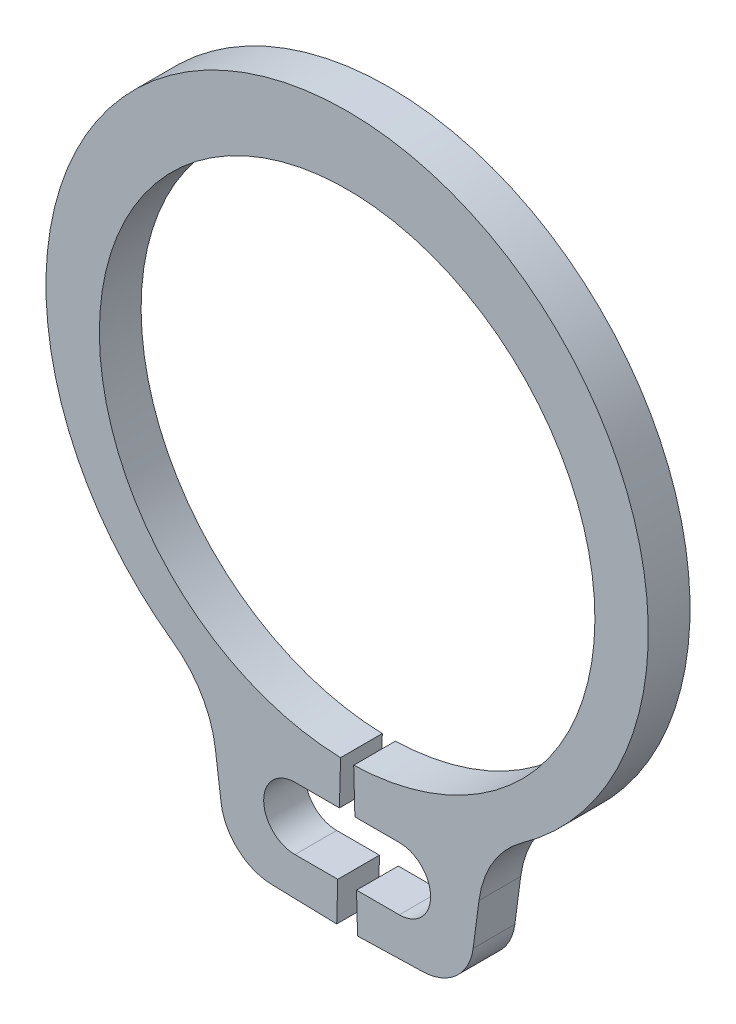
ISO-10303-21;
HEADER;
FILE_DESCRIPTION(('STEP AP214'),'2;1');
FILE_NAME('part.step','',(''),(''),'','','');
FILE_SCHEMA(('AUTOMOTIVE_DESIGN { 1 0 10303 214 1 1 1 1 }'));
ENDSEC;
DATA;
#1=APPLICATION_CONTEXT('core data for automotive mechanical design processes');
#2=APPLICATION_PROTOCOL_DEFINITION('international standard','automotive_design',2000,#1);
#3=PRODUCT_CONTEXT('',#1,'mechanical');
#4=PRODUCT('Part','Part','',(#3));
#5=PRODUCT_RELATED_PRODUCT_CATEGORY('part','',(#4));
#6=PRODUCT_DEFINITION_FORMATION('','',#4);
#7=PRODUCT_DEFINITION_CONTEXT('part definition',#1,'design');
#8=PRODUCT_DEFINITION('design','',#6,#7);
#9=PRODUCT_DEFINITION_SHAPE('','',#8);
#10=(LENGTH_UNIT() NAMED_UNIT(*) SI_UNIT(.MILLI.,.METRE.));
#11=(NAMED_UNIT(*) PLANE_ANGLE_UNIT() SI_UNIT($,.RADIAN.));
#12=(NAMED_UNIT(*) SI_UNIT($,.STERADIAN.) SOLID_ANGLE_UNIT());
#13=UNCERTAINTY_MEASURE_WITH_UNIT(LENGTH_MEASURE(1.E-05),#10,'distance_accuracy_value','');
#14=(GEOMETRIC_REPRESENTATION_CONTEXT(3) GLOBAL_UNCERTAINTY_ASSIGNED_CONTEXT((#13)) GLOBAL_UNIT_ASSIGNED_CONTEXT((#10,
#11,#12)) REPRESENTATION_CONTEXT('',''));
#15=CARTESIAN_POINT('',(0.,0.,0.));
#16=DIRECTION('',(0.,0.,1.));
#17=DIRECTION('',(1.,0.,0.));
#18=AXIS2_PLACEMENT_3D('',#15,#16,#17);
#19=CARTESIAN_POINT('',(-0.0629139072847682,-2.37416655697745,-0.4));
#20=DIRECTION('',(0.999649076622085,-0.0264900662251656,0.));
#21=DIRECTION('',(0.0264900662251656,0.999649076622085,0.));
#22=AXIS2_PLACEMENT_3D('',#19,#20,#21);
#23=PLANE('',#22);
#24=DIRECTION('',(0.,0.,1.));
#25=VECTOR('',#24,1.);
#26=CARTESIAN_POINT('',(-0.0741294083433198,-2.79740314618553,-0.4));
#27=LINE('',#26,#25);
#28=CARTESIAN_POINT('',(-0.0741294083433198,-2.79740314618553,-0.4));
#29=VERTEX_POINT('',#28);
#30=CARTESIAN_POINT('',(-0.0741294083433198,-2.79740314618553,0.));
#31=VERTEX_POINT('',#30);
#32=EDGE_CURVE('E201',#29,#31,#27,.T.);
#33=ORIENTED_EDGE('',*,*,#32,.F.);
#34=DIRECTION('',(0.0264900662251656,0.999649076622085,0.));
#35=VECTOR('',#34,1.);
#36=CARTESIAN_POINT('',(-0.0629139072847682,-2.37416655697745,-0.4));
#37=LINE('',#36,#35);
#38=CARTESIAN_POINT('',(-0.0629139072847682,-2.37416655697745,-0.4));
#39=VERTEX_POINT('',#38);
#40=EDGE_CURVE('E190',#29,#39,#37,.T.);
#41=ORIENTED_EDGE('',*,*,#40,.T.);
#42=DIRECTION('',(0.,0.,1.));
#43=VECTOR('',#42,1.);
#44=CARTESIAN_POINT('',(-0.0629139072847682,-2.37416655697745,-0.4));
#45=LINE('',#44,#43);
#46=CARTESIAN_POINT('',(-0.0629139072847682,-2.37416655697745,0.));
#47=VERTEX_POINT('',#46);
#48=EDGE_CURVE('E11',#39,#47,#45,.T.);
#49=ORIENTED_EDGE('',*,*,#48,.T.);
#50=DIRECTION('',(0.0264900662251656,0.999649076622085,0.));
#51=VECTOR('',#50,1.);
#52=CARTESIAN_POINT('',(-0.0629139072847682,-2.37416655697745,0.));
#53=LINE('',#52,#51);
#54=EDGE_CURVE('E279',#31,#47,#53,.T.);
#55=ORIENTED_EDGE('',*,*,#54,.F.);
#56=EDGE_LOOP('',(#33,#41,#49,#55));
#57=FACE_BOUND('',#56,.T.);
#58=ADVANCED_FACE('F30',(#57),#23,.T.);
#59=CARTESIAN_POINT('',(0.0629139072847682,-2.37416655697745,-0.4));
#60=DIRECTION('',(-0.999649076622085,-0.0264900662251656,0.));
#61=DIRECTION('',(0.0264900662251656,-0.999649076622085,0.));
#62=AXIS2_PLACEMENT_3D('',#59,#60,#61);
#63=PLANE('',#62);
#64=DIRECTION('',(0.,0.,-1.));
#65=VECTOR('',#64,1.);
#66=CARTESIAN_POINT('',(0.0741294083433198,-2.79740314618553,-0.4));
#67=LINE('',#66,#65);
#68=CARTESIAN_POINT('',(0.0741294083433198,-2.79740314618553,0.));
#69=VERTEX_POINT('',#68);
#70=CARTESIAN_POINT('',(0.0741294083433198,-2.79740314618553,-0.4));
#71=VERTEX_POINT('',#70);
#72=EDGE_CURVE('E312',#69,#71,#67,.T.);
#73=ORIENTED_EDGE('',*,*,#72,.F.);
#74=DIRECTION('',(0.0264900662251656,-0.999649076622085,0.));
#75=VECTOR('',#74,1.);
#76=CARTESIAN_POINT('',(0.0629139072847682,-2.37416655697745,0.));
#77=LINE('',#76,#75);
#78=CARTESIAN_POINT('',(0.0629139072847682,-2.37416655697745,0.));
#79=VERTEX_POINT('',#78);
#80=EDGE_CURVE('E249',#79,#69,#77,.T.);
#81=ORIENTED_EDGE('',*,*,#80,.F.);
#82=DIRECTION('',(0.,0.,1.));
#83=VECTOR('',#82,1.);
#84=CARTESIAN_POINT('',(0.0629139072847682,-2.37416655697745,-0.4));
#85=LINE('',#84,#83);
#86=CARTESIAN_POINT('',(0.0629139072847682,-2.37416655697745,-0.4));
#87=VERTEX_POINT('',#86);
#88=EDGE_CURVE('E34',#87,#79,#85,.T.);
#89=ORIENTED_EDGE('',*,*,#88,.F.);
#90=DIRECTION('',(0.0264900662251656,-0.999649076622085,0.));
#91=VECTOR('',#90,1.);
#92=CARTESIAN_POINT('',(0.0629139072847682,-2.37416655697745,-0.4));
#93=LINE('',#92,#91);
#94=EDGE_CURVE('E213',#87,#71,#93,.T.);
#95=ORIENTED_EDGE('',*,*,#94,.T.);
#96=EDGE_LOOP('',(#73,#81,#89,#95));
#97=FACE_BOUND('',#96,.T.);
#98=ADVANCED_FACE('F311',(#97),#63,.T.);
#99=CARTESIAN_POINT('',(0.,0.,-0.4));
#100=DIRECTION('',(0.,0.,1.));
#101=DIRECTION('',(1.,0.,0.));
#102=AXIS2_PLACEMENT_3D('',#99,#100,#101);
#103=CYLINDRICAL_SURFACE('',#102,2.375);
#104=CARTESIAN_POINT('',(0.,0.,0.));
#105=DIRECTION('',(0.,0.,-1.));
#106=DIRECTION('',(1.,0.,0.));
#107=AXIS2_PLACEMENT_3D('',#104,#105,#106);
#108=CIRCLE('',#107,2.375);
#109=EDGE_CURVE('E206',#47,#79,#108,.T.);
#110=ORIENTED_EDGE('',*,*,#109,.F.);
#111=ORIENTED_EDGE('',*,*,#48,.F.);
#112=CARTESIAN_POINT('',(0.,0.,-0.4));
#113=DIRECTION('',(0.,0.,-1.));
#114=DIRECTION('',(1.,0.,0.));
#115=AXIS2_PLACEMENT_3D('',#112,#113,#114);
#116=CIRCLE('',#115,2.375);
#117=EDGE_CURVE('E208',#39,#87,#116,.T.);
#118=ORIENTED_EDGE('',*,*,#117,.T.);
#119=ORIENTED_EDGE('',*,*,#88,.T.);
#120=EDGE_LOOP('',(#110,#111,#118,#119));
#121=FACE_BOUND('',#120,.T.);
#122=ADVANCED_FACE('F32',(#121),#103,.F.);
#123=DIRECTION('',(0.,0.,-1.));
#124=VECTOR('',#123,1.);
#125=CARTESIAN_POINT('',(-0.0900290276265256,-3.39740314618553,-0.4));
#126=LINE('',#125,#124);
#127=CARTESIAN_POINT('',(-0.0900290276265256,-3.39740314618553,0.));
#128=VERTEX_POINT('',#127);
#129=CARTESIAN_POINT('',(-0.0900290276265256,-3.39740314618553,-0.4));
#130=VERTEX_POINT('',#129);
#131=EDGE_CURVE('E333',#128,#130,#126,.T.);
#132=ORIENTED_EDGE('',*,*,#131,.F.);
#133=CARTESIAN_POINT('',(-0.1,-3.77367526424837,0.));
#134=VERTEX_POINT('',#133);
#135=EDGE_CURVE('E212',#134,#128,#53,.T.);
#136=ORIENTED_EDGE('',*,*,#135,.F.);
#137=DIRECTION('',(0.,0.,1.));
#138=VECTOR('',#137,1.);
#139=CARTESIAN_POINT('',(-0.1,-3.77367526424837,-0.4));
#140=LINE('',#139,#138);
#141=CARTESIAN_POINT('',(-0.1,-3.77367526424837,-0.4));
#142=VERTEX_POINT('',#141);
#143=EDGE_CURVE('E39',#142,#134,#140,.T.);
#144=ORIENTED_EDGE('',*,*,#143,.F.);
#145=EDGE_CURVE('E243',#142,#130,#37,.T.);
#146=ORIENTED_EDGE('',*,*,#145,.T.);
#147=EDGE_LOOP('',(#132,#136,#144,#146));
#148=FACE_BOUND('',#147,.T.);
#149=ADVANCED_FACE('F381',(#148),#23,.T.);
#150=CARTESIAN_POINT('',(-0.1,-3.77367526424837,-0.4));
#151=DIRECTION('',(-0.0264900662251672,-0.999649076622085,0.));
#152=DIRECTION('',(0.999649076622085,-0.0264900662251672,0.));
#153=AXIS2_PLACEMENT_3D('',#150,#151,#152);
#154=PLANE('',#153);
#155=DIRECTION('',(0.999649076622085,-0.0264900662251672,0.));
#156=VECTOR('',#155,1.);
#157=CARTESIAN_POINT('',(-0.1,-3.77367526424837,0.));
#158=LINE('',#157,#156);
#159=CARTESIAN_POINT('',(-0.725313694267848,-3.75710484812931,0.));
#160=VERTEX_POINT('',#159);
#161=EDGE_CURVE('E276',#160,#134,#158,.T.);
#162=ORIENTED_EDGE('',*,*,#161,.F.);
#163=DIRECTION('',(0.,0.,1.));
#164=VECTOR('',#163,1.);
#165=CARTESIAN_POINT('',(-0.725313694267848,-3.75710484812931,-0.4));
#166=LINE('',#165,#164);
#167=CARTESIAN_POINT('',(-0.725313694267848,-3.75710484812931,-0.4));
#168=VERTEX_POINT('',#167);
#169=EDGE_CURVE('E283',#168,#160,#166,.T.);
#170=ORIENTED_EDGE('',*,*,#169,.F.);
#171=DIRECTION('',(0.999649076622085,-0.0264900662251672,0.));
#172=VECTOR('',#171,1.);
#173=CARTESIAN_POINT('',(-0.1,-3.77367526424837,-0.4));
#174=LINE('',#173,#172);
#175=EDGE_CURVE('E240',#168,#142,#174,.T.);
#176=ORIENTED_EDGE('',*,*,#175,.T.);
#177=ORIENTED_EDGE('',*,*,#143,.T.);
#178=EDGE_LOOP('',(#162,#170,#176,#177));
#179=FACE_BOUND('',#178,.T.);
#180=ADVANCED_FACE('F377',(#179),#154,.T.);
#181=CARTESIAN_POINT('',(-0.712068661155266,-3.25728030981827,-0.4));
#182=DIRECTION('',(0.,0.,1.));
#183=DIRECTION('',(1.,0.,0.));
#184=AXIS2_PLACEMENT_3D('',#181,#182,#183);
#185=CYLINDRICAL_SURFACE('',#184,0.499999999999999);
#186=CARTESIAN_POINT('',(-0.712068661155266,-3.25728030981827,0.));
#187=DIRECTION('',(0.,0.,1.));
#188=DIRECTION('',(1.,0.,0.));
#189=AXIS2_PLACEMENT_3D('',#186,#187,#188);
#190=CIRCLE('',#189,0.499999999999999);
#191=CARTESIAN_POINT('',(-1.20779109184217,-3.3225434059283,0.));
#192=VERTEX_POINT('',#191);
#193=EDGE_CURVE('E273',#192,#160,#190,.T.);
#194=ORIENTED_EDGE('',*,*,#193,.F.);
#195=DIRECTION('',(0.,0.,1.));
#196=VECTOR('',#195,1.);
#197=CARTESIAN_POINT('',(-1.20779109184217,-3.3225434059283,-0.4));
#198=LINE('',#197,#196);
#199=CARTESIAN_POINT('',(-1.20779109184217,-3.3225434059283,-0.4));
#200=VERTEX_POINT('',#199);
#201=EDGE_CURVE('E285',#200,#192,#198,.T.);
#202=ORIENTED_EDGE('',*,*,#201,.F.);
#203=CARTESIAN_POINT('',(-0.712068661155266,-3.25728030981827,-0.4));
#204=DIRECTION('',(0.,0.,1.));
#205=DIRECTION('',(1.,0.,0.));
#206=AXIS2_PLACEMENT_3D('',#203,#204,#205);
#207=CIRCLE('',#206,0.499999999999999);
#208=EDGE_CURVE('E237',#200,#168,#207,.T.);
#209=ORIENTED_EDGE('',*,*,#208,.T.);
#210=ORIENTED_EDGE('',*,*,#169,.T.);
#211=EDGE_LOOP('',(#194,#202,#209,#210));
#212=FACE_BOUND('',#211,.T.);
#213=ADVANCED_FACE('F373',(#212),#185,.T.);
#214=CARTESIAN_POINT('',(-1.26381231955327,-2.89701993514179,-0.4));
#215=DIRECTION('',(-0.99144486137381,-0.130526192220052,0.));
#216=DIRECTION('',(0.130526192220052,-0.99144486137381,0.));
#217=AXIS2_PLACEMENT_3D('',#214,#215,#216);
#218=PLANE('',#217);
#219=DIRECTION('',(0.130526192220052,-0.99144486137381,0.));
#220=VECTOR('',#219,1.);
#221=CARTESIAN_POINT('',(-1.26381231955327,-2.89701993514179,0.));
#222=LINE('',#221,#220);
#223=CARTESIAN_POINT('',(-1.26381231955327,-2.89701993514179,0.));
#224=VERTEX_POINT('',#223);
#225=EDGE_CURVE('E270',#224,#192,#222,.T.);
#226=ORIENTED_EDGE('',*,*,#225,.F.);
#227=DIRECTION('',(0.,0.,1.));
#228=VECTOR('',#227,1.);
#229=CARTESIAN_POINT('',(-1.26381231955327,-2.89701993514179,-0.4));
#230=LINE('',#229,#228);
#231=CARTESIAN_POINT('',(-1.26381231955327,-2.89701993514179,-0.4));
#232=VERTEX_POINT('',#231);
#233=EDGE_CURVE('E287',#232,#224,#230,.T.);
#234=ORIENTED_EDGE('',*,*,#233,.F.);
#235=DIRECTION('',(0.130526192220052,-0.99144486137381,0.));
#236=VECTOR('',#235,1.);
#237=CARTESIAN_POINT('',(-1.26381231955327,-2.89701993514179,-0.4));
#238=LINE('',#237,#236);
#239=EDGE_CURVE('E234',#232,#200,#238,.T.);
#240=ORIENTED_EDGE('',*,*,#239,.T.);
#241=ORIENTED_EDGE('',*,*,#201,.T.);
#242=EDGE_LOOP('',(#226,#234,#240,#241));
#243=FACE_BOUND('',#242,.T.);
#244=ADVANCED_FACE('F368',(#243),#218,.T.);
#245=CARTESIAN_POINT('',(-2.25495656057124,-3.02750654994117,-0.4));
#246=DIRECTION('',(0.,0.,1.));
#247=DIRECTION('',(1.,0.,0.));
#248=AXIS2_PLACEMENT_3D('',#245,#246,#247);
#249=CYLINDRICAL_SURFACE('',#248,0.999696785602961);
#250=CARTESIAN_POINT('',(-2.25495656057124,-3.02750654994117,0.));
#251=DIRECTION('',(0.,0.,-1.));
#252=DIRECTION('',(1.,0.,0.));
#253=AXIS2_PLACEMENT_3D('',#250,#251,#252);
#254=CIRCLE('',#253,0.999696785602961);
#255=CARTESIAN_POINT('',(-1.67494729161683,-2.21326892426188,0.));
#256=VERTEX_POINT('',#255);
#257=EDGE_CURVE('E267',#256,#224,#254,.T.);
#258=ORIENTED_EDGE('',*,*,#257,.F.);
#259=DIRECTION('',(0.,0.,1.));
#260=VECTOR('',#259,1.);
#261=CARTESIAN_POINT('',(-1.67494729161683,-2.21326892426188,-0.4));
#262=LINE('',#261,#260);
#263=CARTESIAN_POINT('',(-1.67494729161683,-2.21326892426188,-0.4));
#264=VERTEX_POINT('',#263);
#265=EDGE_CURVE('E289',#264,#256,#262,.T.);
#266=ORIENTED_EDGE('',*,*,#265,.F.);
#267=CARTESIAN_POINT('',(-2.25495656057124,-3.02750654994117,-0.4));
#268=DIRECTION('',(0.,0.,-1.));
#269=DIRECTION('',(1.,0.,0.));
#270=AXIS2_PLACEMENT_3D('',#267,#268,#269);
#271=CIRCLE('',#270,0.999696785602961);
#272=EDGE_CURVE('E231',#264,#232,#271,.T.);
#273=ORIENTED_EDGE('',*,*,#272,.T.);
#274=ORIENTED_EDGE('',*,*,#233,.T.);
#275=EDGE_LOOP('',(#258,#266,#273,#274));
#276=FACE_BOUND('',#275,.T.);
#277=ADVANCED_FACE('F364',(#276),#249,.F.);
#278=CARTESIAN_POINT('',(0.,0.138081612467611,-0.4));
#279=DIRECTION('',(0.,0.,1.));
#280=DIRECTION('',(1.,0.,0.));
#281=AXIS2_PLACEMENT_3D('',#278,#279,#280);
#282=CYLINDRICAL_SURFACE('',#281,2.88691838753239);
#283=CARTESIAN_POINT('',(0.,0.138081612467611,0.));
#284=DIRECTION('',(0.,0.,1.));
#285=DIRECTION('',(1.,0.,0.));
#286=AXIS2_PLACEMENT_3D('',#283,#284,#285);
#287=CIRCLE('',#286,2.88691838753239);
#288=CARTESIAN_POINT('',(1.67494729161682,-2.21326892426188,0.));
#289=VERTEX_POINT('',#288);
#290=EDGE_CURVE('E264',#289,#256,#287,.T.);
#291=ORIENTED_EDGE('',*,*,#290,.F.);
#292=DIRECTION('',(0.,0.,1.));
#293=VECTOR('',#292,1.);
#294=CARTESIAN_POINT('',(1.67494729161682,-2.21326892426188,-0.4));
#295=LINE('',#294,#293);
#296=CARTESIAN_POINT('',(1.67494729161682,-2.21326892426188,-0.4));
#297=VERTEX_POINT('',#296);
#298=EDGE_CURVE('E291',#297,#289,#295,.T.);
#299=ORIENTED_EDGE('',*,*,#298,.F.);
#300=CARTESIAN_POINT('',(0.,0.138081612467611,-0.4));
#301=DIRECTION('',(0.,0.,1.));
#302=DIRECTION('',(1.,0.,0.));
#303=AXIS2_PLACEMENT_3D('',#300,#301,#302);
#304=CIRCLE('',#303,2.88691838753239);
#305=EDGE_CURVE('E228',#297,#264,#304,.T.);
#306=ORIENTED_EDGE('',*,*,#305,.T.);
#307=ORIENTED_EDGE('',*,*,#265,.T.);
#308=EDGE_LOOP('',(#291,#299,#306,#307));
#309=FACE_BOUND('',#308,.T.);
#310=ADVANCED_FACE('F360',(#309),#282,.T.);
#311=CARTESIAN_POINT('',(2.25495656057124,-3.02750654994117,-0.4));
#312=DIRECTION('',(0.,0.,1.));
#313=DIRECTION('',(1.,0.,0.));
#314=AXIS2_PLACEMENT_3D('',#311,#312,#313);
#315=CYLINDRICAL_SURFACE('',#314,0.999696785602961);
#316=CARTESIAN_POINT('',(2.25495656057124,-3.02750654994117,0.));
#317=DIRECTION('',(0.,0.,-1.));
#318=DIRECTION('',(1.,0.,0.));
#319=AXIS2_PLACEMENT_3D('',#316,#317,#318);
#320=CIRCLE('',#319,0.999696785602961);
#321=CARTESIAN_POINT('',(1.26381231955327,-2.89701993514179,0.));
#322=VERTEX_POINT('',#321);
#323=EDGE_CURVE('E261',#322,#289,#320,.T.);
#324=ORIENTED_EDGE('',*,*,#323,.F.);
#325=DIRECTION('',(0.,0.,1.));
#326=VECTOR('',#325,1.);
#327=CARTESIAN_POINT('',(1.26381231955327,-2.89701993514179,-0.4));
#328=LINE('',#327,#326);
#329=CARTESIAN_POINT('',(1.26381231955327,-2.89701993514179,-0.4));
#330=VERTEX_POINT('',#329);
#331=EDGE_CURVE('E293',#330,#322,#328,.T.);
#332=ORIENTED_EDGE('',*,*,#331,.F.);
#333=CARTESIAN_POINT('',(2.25495656057124,-3.02750654994117,-0.4));
#334=DIRECTION('',(0.,0.,-1.));
#335=DIRECTION('',(1.,0.,0.));
#336=AXIS2_PLACEMENT_3D('',#333,#334,#335);
#337=CIRCLE('',#336,0.999696785602961);
#338=EDGE_CURVE('E225',#330,#297,#337,.T.);
#339=ORIENTED_EDGE('',*,*,#338,.T.);
#340=ORIENTED_EDGE('',*,*,#298,.T.);
#341=EDGE_LOOP('',(#324,#332,#339,#340));
#342=FACE_BOUND('',#341,.T.);
#343=ADVANCED_FACE('F356',(#342),#315,.F.);
#344=CARTESIAN_POINT('',(1.26381231955327,-2.89701993514179,-0.4));
#345=DIRECTION('',(0.99144486137381,-0.130526192220052,0.));
#346=DIRECTION('',(0.130526192220052,0.99144486137381,0.));
#347=AXIS2_PLACEMENT_3D('',#344,#345,#346);
#348=PLANE('',#347);
#349=DIRECTION('',(0.130526192220052,0.99144486137381,0.));
#350=VECTOR('',#349,1.);
#351=CARTESIAN_POINT('',(1.26381231955327,-2.89701993514179,0.));
#352=LINE('',#351,#350);
#353=CARTESIAN_POINT('',(1.20779109184217,-3.3225434059283,0.));
#354=VERTEX_POINT('',#353);
#355=EDGE_CURVE('E258',#354,#322,#352,.T.);
#356=ORIENTED_EDGE('',*,*,#355,.F.);
#357=DIRECTION('',(0.,0.,1.));
#358=VECTOR('',#357,1.);
#359=CARTESIAN_POINT('',(1.20779109184217,-3.3225434059283,-0.4));
#360=LINE('',#359,#358);
#361=CARTESIAN_POINT('',(1.20779109184217,-3.3225434059283,-0.4));
#362=VERTEX_POINT('',#361);
#363=EDGE_CURVE('E295',#362,#354,#360,.T.);
#364=ORIENTED_EDGE('',*,*,#363,.F.);
#365=DIRECTION('',(0.130526192220052,0.99144486137381,0.));
#366=VECTOR('',#365,1.);
#367=CARTESIAN_POINT('',(1.26381231955327,-2.89701993514179,-0.4));
#368=LINE('',#367,#366);
#369=EDGE_CURVE('E222',#362,#330,#368,.T.);
#370=ORIENTED_EDGE('',*,*,#369,.T.);
#371=ORIENTED_EDGE('',*,*,#331,.T.);
#372=EDGE_LOOP('',(#356,#364,#370,#371));
#373=FACE_BOUND('',#372,.T.);
#374=ADVANCED_FACE('F352',(#373),#348,.T.);
#375=CARTESIAN_POINT('',(0.712068661155266,-3.25728030981827,-0.4));
#376=DIRECTION('',(0.,0.,1.));
#377=DIRECTION('',(1.,0.,0.));
#378=AXIS2_PLACEMENT_3D('',#375,#376,#377);
#379=CYLINDRICAL_SURFACE('',#378,0.499999999999999);
#380=CARTESIAN_POINT('',(0.712068661155266,-3.25728030981827,0.));
#381=DIRECTION('',(0.,0.,1.));
#382=DIRECTION('',(-1.,0.,0.));
#383=AXIS2_PLACEMENT_3D('',#380,#381,#382);
#384=CIRCLE('',#383,0.499999999999999);
#385=CARTESIAN_POINT('',(0.725313694267848,-3.75710484812931,0.));
#386=VERTEX_POINT('',#385);
#387=EDGE_CURVE('E255',#386,#354,#384,.T.);
#388=ORIENTED_EDGE('',*,*,#387,.F.);
#389=DIRECTION('',(0.,0.,1.));
#390=VECTOR('',#389,1.);
#391=CARTESIAN_POINT('',(0.725313694267848,-3.75710484812931,-0.4));
#392=LINE('',#391,#390);
#393=CARTESIAN_POINT('',(0.725313694267848,-3.75710484812931,-0.4));
#394=VERTEX_POINT('',#393);
#395=EDGE_CURVE('E297',#394,#386,#392,.T.);
#396=ORIENTED_EDGE('',*,*,#395,.F.);
#397=CARTESIAN_POINT('',(0.712068661155266,-3.25728030981827,-0.4));
#398=DIRECTION('',(0.,0.,1.));
#399=DIRECTION('',(-1.,0.,0.));
#400=AXIS2_PLACEMENT_3D('',#397,#398,#399);
#401=CIRCLE('',#400,0.499999999999999);
#402=EDGE_CURVE('E219',#394,#362,#401,.T.);
#403=ORIENTED_EDGE('',*,*,#402,.T.);
#404=ORIENTED_EDGE('',*,*,#363,.T.);
#405=EDGE_LOOP('',(#388,#396,#403,#404));
#406=FACE_BOUND('',#405,.T.);
#407=ADVANCED_FACE('F349',(#406),#379,.T.);
#408=CARTESIAN_POINT('',(0.1,-3.77367526424837,-0.4));
#409=DIRECTION('',(0.0264900662251672,-0.999649076622085,0.));
#410=DIRECTION('',(0.999649076622085,0.0264900662251672,0.));
#411=AXIS2_PLACEMENT_3D('',#408,#409,#410);
#412=PLANE('',#411);
#413=DIRECTION('',(0.999649076622085,0.0264900662251672,0.));
#414=VECTOR('',#413,1.);
#415=CARTESIAN_POINT('',(0.1,-3.77367526424837,0.));
#416=LINE('',#415,#414);
#417=CARTESIAN_POINT('',(0.1,-3.77367526424837,0.));
#418=VERTEX_POINT('',#417);
#419=EDGE_CURVE('E252',#418,#386,#416,.T.);
#420=ORIENTED_EDGE('',*,*,#419,.F.);
#421=DIRECTION('',(0.,0.,1.));
#422=VECTOR('',#421,1.);
#423=CARTESIAN_POINT('',(0.1,-3.77367526424837,-0.4));
#424=LINE('',#423,#422);
#425=CARTESIAN_POINT('',(0.1,-3.77367526424837,-0.4));
#426=VERTEX_POINT('',#425);
#427=EDGE_CURVE('E298',#426,#418,#424,.T.);
#428=ORIENTED_EDGE('',*,*,#427,.F.);
#429=DIRECTION('',(0.999649076622085,0.0264900662251672,0.));
#430=VECTOR('',#429,1.);
#431=CARTESIAN_POINT('',(0.1,-3.77367526424837,-0.4));
#432=LINE('',#431,#430);
#433=EDGE_CURVE('E216',#426,#394,#432,.T.);
#434=ORIENTED_EDGE('',*,*,#433,.T.);
#435=ORIENTED_EDGE('',*,*,#395,.T.);
#436=EDGE_LOOP('',(#420,#428,#434,#435));
#437=FACE_BOUND('',#436,.T.);
#438=ADVANCED_FACE('F345',(#437),#412,.T.);
#439=DIRECTION('',(0.,0.,1.));
#440=VECTOR('',#439,1.);
#441=CARTESIAN_POINT('',(0.0900290276265256,-3.39740314618553,-0.4));
#442=LINE('',#441,#440);
#443=CARTESIAN_POINT('',(0.0900290276265256,-3.39740314618553,-0.4));
#444=VERTEX_POINT('',#443);
#445=CARTESIAN_POINT('',(0.0900290276265256,-3.39740314618553,0.));
#446=VERTEX_POINT('',#445);
#447=EDGE_CURVE('E328',#444,#446,#442,.T.);
#448=ORIENTED_EDGE('',*,*,#447,.F.);
#449=EDGE_CURVE('E211',#444,#426,#93,.T.);
#450=ORIENTED_EDGE('',*,*,#449,.T.);
#451=ORIENTED_EDGE('',*,*,#427,.T.);
#452=EDGE_CURVE('E248',#446,#418,#77,.T.);
#453=ORIENTED_EDGE('',*,*,#452,.F.);
#454=EDGE_LOOP('',(#448,#450,#451,#453));
#455=FACE_BOUND('',#454,.T.);
#456=ADVANCED_FACE('F343',(#455),#63,.T.);
#457=CARTESIAN_POINT('',(0.,0.,-0.4));
#458=DIRECTION('',(0.,0.,1.));
#459=DIRECTION('',(1.,0.,0.));
#460=AXIS2_PLACEMENT_3D('',#457,#458,#459);
#461=PLANE('',#460);
#462=CARTESIAN_POINT('',(0.5,-3.09740314618553,-0.4));
#463=DIRECTION('',(0.,0.,1.));
#464=DIRECTION('',(1.,0.,0.));
#465=AXIS2_PLACEMENT_3D('',#462,#463,#464);
#466=CIRCLE('',#465,0.3);
#467=CARTESIAN_POINT('',(0.5,-3.39740314618553,-0.4));
#468=VERTEX_POINT('',#467);
#469=CARTESIAN_POINT('',(0.5,-2.79740314618553,-0.4));
#470=VERTEX_POINT('',#469);
#471=EDGE_CURVE('E199',#468,#470,#466,.T.);
#472=ORIENTED_EDGE('',*,*,#471,.T.);
#473=DIRECTION('',(-1.,0.,0.));
#474=VECTOR('',#473,1.);
#475=CARTESIAN_POINT('',(-0.5,-2.79740314618553,-0.4));
#476=LINE('',#475,#474);
#477=EDGE_CURVE('E55',#470,#71,#476,.T.);
#478=ORIENTED_EDGE('',*,*,#477,.T.);
#479=ORIENTED_EDGE('',*,*,#94,.F.);
#480=ORIENTED_EDGE('',*,*,#117,.F.);
#481=ORIENTED_EDGE('',*,*,#40,.F.);
#482=CARTESIAN_POINT('',(-0.5,-2.79740314618553,-0.4));
#483=VERTEX_POINT('',#482);
#484=EDGE_CURVE('E171',#29,#483,#476,.T.);
#485=ORIENTED_EDGE('',*,*,#484,.T.);
#486=CARTESIAN_POINT('',(-0.5,-3.09740314618553,-0.4));
#487=DIRECTION('',(0.,0.,1.));
#488=DIRECTION('',(1.,0.,0.));
#489=AXIS2_PLACEMENT_3D('',#486,#487,#488);
#490=CIRCLE('',#489,0.3);
#491=CARTESIAN_POINT('',(-0.5,-3.39740314618553,-0.4));
#492=VERTEX_POINT('',#491);
#493=EDGE_CURVE('E188',#483,#492,#490,.T.);
#494=ORIENTED_EDGE('',*,*,#493,.T.);
#495=DIRECTION('',(1.,0.,0.));
#496=VECTOR('',#495,1.);
#497=CARTESIAN_POINT('',(0.5,-3.39740314618553,-0.4));
#498=LINE('',#497,#496);
#499=EDGE_CURVE('E180',#492,#130,#498,.T.);
#500=ORIENTED_EDGE('',*,*,#499,.T.);
#501=ORIENTED_EDGE('',*,*,#145,.F.);
#502=ORIENTED_EDGE('',*,*,#175,.F.);
#503=ORIENTED_EDGE('',*,*,#208,.F.);
#504=ORIENTED_EDGE('',*,*,#239,.F.);
#505=ORIENTED_EDGE('',*,*,#272,.F.);
#506=ORIENTED_EDGE('',*,*,#305,.F.);
#507=ORIENTED_EDGE('',*,*,#338,.F.);
#508=ORIENTED_EDGE('',*,*,#369,.F.);
#509=ORIENTED_EDGE('',*,*,#402,.F.);
#510=ORIENTED_EDGE('',*,*,#433,.F.);
#511=ORIENTED_EDGE('',*,*,#449,.F.);
#512=EDGE_CURVE('E320',#444,#468,#498,.T.);
#513=ORIENTED_EDGE('',*,*,#512,.T.);
#514=EDGE_LOOP('',(#472,#478,#479,#480,#481,#485,#494,#500,#501,#502,#503,#504,#505,#506,#507,
#508,#509,#510,#511,#513));
#515=FACE_BOUND('',#514,.T.);
#516=ADVANCED_FACE('F186',(#515),#461,.F.);
#517=CARTESIAN_POINT('',(0.,0.,0.));
#518=DIRECTION('',(0.,0.,1.));
#519=DIRECTION('',(1.,0.,0.));
#520=AXIS2_PLACEMENT_3D('',#517,#518,#519);
#521=PLANE('',#520);
#522=DIRECTION('',(-1.,0.,0.));
#523=VECTOR('',#522,1.);
#524=CARTESIAN_POINT('',(-0.5,-2.79740314618553,0.));
#525=LINE('',#524,#523);
#526=CARTESIAN_POINT('',(0.5,-2.79740314618553,0.));
#527=VERTEX_POINT('',#526);
#528=EDGE_CURVE('E323',#527,#69,#525,.T.);
#529=ORIENTED_EDGE('',*,*,#528,.F.);
#530=CARTESIAN_POINT('',(0.5,-3.09740314618553,0.));
#531=DIRECTION('',(0.,0.,1.));
#532=DIRECTION('',(1.,0.,0.));
#533=AXIS2_PLACEMENT_3D('',#530,#531,#532);
#534=CIRCLE('',#533,0.3);
#535=CARTESIAN_POINT('',(0.5,-3.39740314618553,0.));
#536=VERTEX_POINT('',#535);
#537=EDGE_CURVE('E195',#536,#527,#534,.T.);
#538=ORIENTED_EDGE('',*,*,#537,.F.);
#539=DIRECTION('',(1.,0.,0.));
#540=VECTOR('',#539,1.);
#541=CARTESIAN_POINT('',(0.5,-3.39740314618553,0.));
#542=LINE('',#541,#540);
#543=EDGE_CURVE('E47',#446,#536,#542,.T.);
#544=ORIENTED_EDGE('',*,*,#543,.F.);
#545=ORIENTED_EDGE('',*,*,#452,.T.);
#546=ORIENTED_EDGE('',*,*,#419,.T.);
#547=ORIENTED_EDGE('',*,*,#387,.T.);
#548=ORIENTED_EDGE('',*,*,#355,.T.);
#549=ORIENTED_EDGE('',*,*,#323,.T.);
#550=ORIENTED_EDGE('',*,*,#290,.T.);
#551=ORIENTED_EDGE('',*,*,#257,.T.);
#552=ORIENTED_EDGE('',*,*,#225,.T.);
#553=ORIENTED_EDGE('',*,*,#193,.T.);
#554=ORIENTED_EDGE('',*,*,#161,.T.);
#555=ORIENTED_EDGE('',*,*,#135,.T.);
#556=CARTESIAN_POINT('',(-0.5,-3.39740314618553,0.));
#557=VERTEX_POINT('',#556);
#558=EDGE_CURVE('E191',#557,#128,#542,.T.);
#559=ORIENTED_EDGE('',*,*,#558,.F.);
#560=CARTESIAN_POINT('',(-0.5,-3.09740314618553,0.));
#561=DIRECTION('',(0.,0.,1.));
#562=DIRECTION('',(1.,0.,0.));
#563=AXIS2_PLACEMENT_3D('',#560,#561,#562);
#564=CIRCLE('',#563,0.3);
#565=CARTESIAN_POINT('',(-0.5,-2.79740314618553,0.));
#566=VERTEX_POINT('',#565);
#567=EDGE_CURVE('E196',#566,#557,#564,.T.);
#568=ORIENTED_EDGE('',*,*,#567,.F.);
#569=EDGE_CURVE('E174',#31,#566,#525,.T.);
#570=ORIENTED_EDGE('',*,*,#569,.F.);
#571=ORIENTED_EDGE('',*,*,#54,.T.);
#572=ORIENTED_EDGE('',*,*,#109,.T.);
#573=ORIENTED_EDGE('',*,*,#80,.T.);
#574=EDGE_LOOP('',(#529,#538,#544,#545,#546,#547,#548,#549,#550,#551,#552,#553,#554,#555,#559,
#568,#570,#571,#572,#573));
#575=FACE_BOUND('',#574,.T.);
#576=ADVANCED_FACE('F315',(#575),#521,.T.);
#577=CARTESIAN_POINT('',(0.5,-3.09740314618553,-0.4));
#578=DIRECTION('',(0.,0.,1.));
#579=DIRECTION('',(1.,0.,0.));
#580=AXIS2_PLACEMENT_3D('',#577,#578,#579);
#581=CYLINDRICAL_SURFACE('',#580,0.3);
#582=ORIENTED_EDGE('',*,*,#537,.T.);
#583=DIRECTION('',(0.,0.,1.));
#584=VECTOR('',#583,1.);
#585=CARTESIAN_POINT('',(0.5,-2.79740314618553,-0.4));
#586=LINE('',#585,#584);
#587=EDGE_CURVE('E326',#470,#527,#586,.T.);
#588=ORIENTED_EDGE('',*,*,#587,.F.);
#589=ORIENTED_EDGE('',*,*,#471,.F.);
#590=DIRECTION('',(0.,0.,1.));
#591=VECTOR('',#590,1.);
#592=CARTESIAN_POINT('',(0.5,-3.39740314618553,-0.4));
#593=LINE('',#592,#591);
#594=EDGE_CURVE('E329',#468,#536,#593,.T.);
#595=ORIENTED_EDGE('',*,*,#594,.T.);
#596=EDGE_LOOP('',(#582,#588,#589,#595));
#597=FACE_BOUND('',#596,.T.);
#598=ADVANCED_FACE('F337',(#597),#581,.F.);
#599=CARTESIAN_POINT('',(-0.5,-3.09740314618553,-0.4));
#600=DIRECTION('',(0.,0.,1.));
#601=DIRECTION('',(1.,0.,0.));
#602=AXIS2_PLACEMENT_3D('',#599,#600,#601);
#603=CYLINDRICAL_SURFACE('',#602,0.3);
#604=ORIENTED_EDGE('',*,*,#567,.T.);
#605=DIRECTION('',(0.,0.,1.));
#606=VECTOR('',#605,1.);
#607=CARTESIAN_POINT('',(-0.5,-3.39740314618553,-0.4));
#608=LINE('',#607,#606);
#609=EDGE_CURVE('E179',#492,#557,#608,.T.);
#610=ORIENTED_EDGE('',*,*,#609,.F.);
#611=ORIENTED_EDGE('',*,*,#493,.F.);
#612=DIRECTION('',(0.,0.,1.));
#613=VECTOR('',#612,1.);
#614=CARTESIAN_POINT('',(-0.5,-2.79740314618553,-0.4));
#615=LINE('',#614,#613);
#616=EDGE_CURVE('E168',#483,#566,#615,.T.);
#617=ORIENTED_EDGE('',*,*,#616,.T.);
#618=EDGE_LOOP('',(#604,#610,#611,#617));
#619=FACE_BOUND('',#618,.T.);
#620=ADVANCED_FACE('F194',(#619),#603,.F.);
#621=CARTESIAN_POINT('',(-0.5,-2.79740314618553,-0.4));
#622=DIRECTION('',(0.,1.,0.));
#623=DIRECTION('',(0.,0.,1.));
#624=AXIS2_PLACEMENT_3D('',#621,#622,#623);
#625=PLANE('',#624);
#626=ORIENTED_EDGE('',*,*,#32,.T.);
#627=ORIENTED_EDGE('',*,*,#569,.T.);
#628=ORIENTED_EDGE('',*,*,#616,.F.);
#629=ORIENTED_EDGE('',*,*,#484,.F.);
#630=EDGE_LOOP('',(#626,#627,#628,#629));
#631=FACE_BOUND('',#630,.T.);
#632=ADVANCED_FACE('F170',(#631),#625,.F.);
#633=CARTESIAN_POINT('',(0.5,-3.39740314618553,-0.4));
#634=DIRECTION('',(0.,-1.,0.));
#635=DIRECTION('',(0.,0.,-1.));
#636=AXIS2_PLACEMENT_3D('',#633,#634,#635);
#637=PLANE('',#636);
#638=ORIENTED_EDGE('',*,*,#131,.T.);
#639=ORIENTED_EDGE('',*,*,#499,.F.);
#640=ORIENTED_EDGE('',*,*,#609,.T.);
#641=ORIENTED_EDGE('',*,*,#558,.T.);
#642=EDGE_LOOP('',(#638,#639,#640,#641));
#643=FACE_BOUND('',#642,.T.);
#644=ADVANCED_FACE('F384',(#643),#637,.F.);
#645=ORIENTED_EDGE('',*,*,#447,.T.);
#646=ORIENTED_EDGE('',*,*,#543,.T.);
#647=ORIENTED_EDGE('',*,*,#594,.F.);
#648=ORIENTED_EDGE('',*,*,#512,.F.);
#649=EDGE_LOOP('',(#645,#646,#647,#648));
#650=FACE_BOUND('',#649,.T.);
#651=ADVANCED_FACE('F338',(#650),#637,.F.);
#652=ORIENTED_EDGE('',*,*,#72,.T.);
#653=ORIENTED_EDGE('',*,*,#477,.F.);
#654=ORIENTED_EDGE('',*,*,#587,.T.);
#655=ORIENTED_EDGE('',*,*,#528,.T.);
#656=EDGE_LOOP('',(#652,#653,#654,#655));
#657=FACE_BOUND('',#656,.T.);
#658=ADVANCED_FACE('F334',(#657),#625,.F.);
#659=CLOSED_SHELL('',(#58,#98,#122,#149,#180,#213,#244,#277,#310,#343,#374,#407,#438,#456,#516,
#576,#598,#620,#632,#644,#651,#658));
#660=MANIFOLD_SOLID_BREP('B2',#659);
#661=ADVANCED_BREP_SHAPE_REPRESENTATION('',(#18,#660),#14);
#662=SHAPE_DEFINITION_REPRESENTATION(#9,#661);
ENDSEC;
END-ISO-10303-21;
